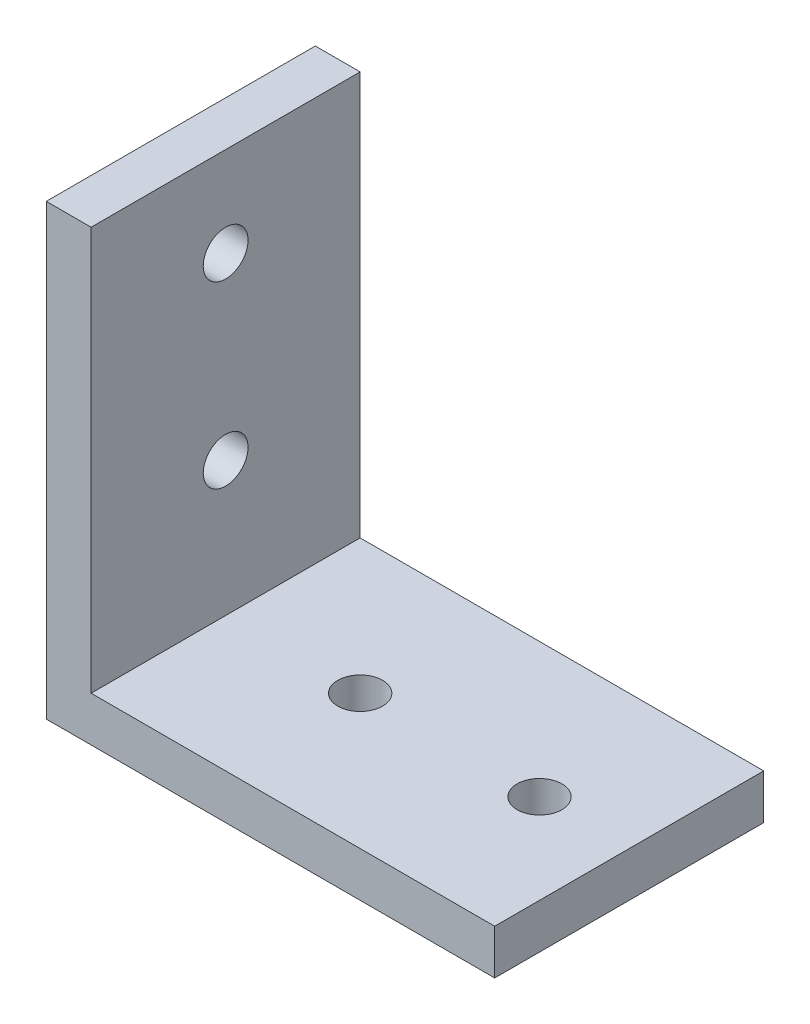
ISO-10303-21;
HEADER;
FILE_DESCRIPTION(('STEP AP214'),'2;1');
FILE_NAME('part.step','',(''),(''),'','','');
FILE_SCHEMA(('AUTOMOTIVE_DESIGN { 1 0 10303 214 1 1 1 1 }'));
ENDSEC;
DATA;
#1=APPLICATION_CONTEXT('core data for automotive mechanical design processes');
#2=APPLICATION_PROTOCOL_DEFINITION('international standard','automotive_design',2000,#1);
#3=PRODUCT_CONTEXT('',#1,'mechanical');
#4=PRODUCT('Part','Part','',(#3));
#5=PRODUCT_RELATED_PRODUCT_CATEGORY('part','',(#4));
#6=PRODUCT_DEFINITION_FORMATION('','',#4);
#7=PRODUCT_DEFINITION_CONTEXT('part definition',#1,'design');
#8=PRODUCT_DEFINITION('design','',#6,#7);
#9=PRODUCT_DEFINITION_SHAPE('','',#8);
#10=(LENGTH_UNIT() NAMED_UNIT(*) SI_UNIT(.MILLI.,.METRE.));
#11=(NAMED_UNIT(*) PLANE_ANGLE_UNIT() SI_UNIT($,.RADIAN.));
#12=(NAMED_UNIT(*) SI_UNIT($,.STERADIAN.) SOLID_ANGLE_UNIT());
#13=UNCERTAINTY_MEASURE_WITH_UNIT(LENGTH_MEASURE(1.E-05),#10,'distance_accuracy_value','');
#14=(GEOMETRIC_REPRESENTATION_CONTEXT(3) GLOBAL_UNCERTAINTY_ASSIGNED_CONTEXT((#13)) GLOBAL_UNIT_ASSIGNED_CONTEXT((#10,
#11,#12)) REPRESENTATION_CONTEXT('',''));
#15=CARTESIAN_POINT('',(0.,0.,0.));
#16=DIRECTION('',(0.,0.,1.));
#17=DIRECTION('',(1.,0.,0.));
#18=AXIS2_PLACEMENT_3D('',#15,#16,#17);
#19=CARTESIAN_POINT('',(100.,0.,30.));
#20=DIRECTION('',(0.,1.,0.));
#21=DIRECTION('',(-1.,0.,0.));
#22=AXIS2_PLACEMENT_3D('',#19,#20,#21);
#23=PLANE('',#22);
#24=CARTESIAN_POINT('',(40.,0.,0.));
#25=DIRECTION('',(0.,1.,0.));
#26=DIRECTION('',(-1.,0.,0.));
#27=AXIS2_PLACEMENT_3D('',#24,#25,#26);
#28=CIRCLE('',#27,5.00000000000001);
#29=CARTESIAN_POINT('',(35.,0.,0.));
#30=VERTEX_POINT('',#29);
#31=EDGE_CURVE('E166',#30,#30,#28,.T.);
#32=ORIENTED_EDGE('',*,*,#31,.T.);
#33=EDGE_LOOP('',(#32));
#34=FACE_BOUND('',#33,.T.);
#35=CARTESIAN_POINT('',(80.,0.,0.));
#36=DIRECTION('',(0.,1.,0.));
#37=DIRECTION('',(-1.,0.,0.));
#38=AXIS2_PLACEMENT_3D('',#35,#36,#37);
#39=CIRCLE('',#38,5.);
#40=CARTESIAN_POINT('',(75.,0.,0.));
#41=VERTEX_POINT('',#40);
#42=EDGE_CURVE('E169',#41,#41,#39,.T.);
#43=ORIENTED_EDGE('',*,*,#42,.T.);
#44=EDGE_LOOP('',(#43));
#45=FACE_BOUND('',#44,.T.);
#46=DIRECTION('',(1.,0.,0.));
#47=VECTOR('',#46,1.);
#48=CARTESIAN_POINT('',(100.,0.,-30.));
#49=LINE('',#48,#47);
#50=CARTESIAN_POINT('',(0.,0.,-30.));
#51=VERTEX_POINT('',#50);
#52=CARTESIAN_POINT('',(100.,0.,-30.));
#53=VERTEX_POINT('',#52);
#54=EDGE_CURVE('E120',#51,#53,#49,.T.);
#55=ORIENTED_EDGE('',*,*,#54,.T.);
#56=DIRECTION('',(0.,0.,-1.));
#57=VECTOR('',#56,1.);
#58=CARTESIAN_POINT('',(100.,0.,30.));
#59=LINE('',#58,#57);
#60=CARTESIAN_POINT('',(100.,0.,30.));
#61=VERTEX_POINT('',#60);
#62=EDGE_CURVE('E11',#61,#53,#59,.T.);
#63=ORIENTED_EDGE('',*,*,#62,.F.);
#64=DIRECTION('',(1.,0.,0.));
#65=VECTOR('',#64,1.);
#66=CARTESIAN_POINT('',(100.,0.,30.));
#67=LINE('',#66,#65);
#68=CARTESIAN_POINT('',(0.,0.,30.));
#69=VERTEX_POINT('',#68);
#70=EDGE_CURVE('E131',#69,#61,#67,.T.);
#71=ORIENTED_EDGE('',*,*,#70,.F.);
#72=DIRECTION('',(0.,0.,-1.));
#73=VECTOR('',#72,1.);
#74=CARTESIAN_POINT('',(0.,0.,30.));
#75=LINE('',#74,#73);
#76=EDGE_CURVE('E116',#69,#51,#75,.T.);
#77=ORIENTED_EDGE('',*,*,#76,.T.);
#78=EDGE_LOOP('',(#55,#63,#71,#77));
#79=FACE_BOUND('',#78,.T.);
#80=ADVANCED_FACE('F36',(#34,#45,#79),#23,.F.);
#81=CARTESIAN_POINT('',(100.,10.,30.));
#82=DIRECTION('',(-1.,0.,0.));
#83=DIRECTION('',(0.,0.,1.));
#84=AXIS2_PLACEMENT_3D('',#81,#82,#83);
#85=PLANE('',#84);
#86=DIRECTION('',(0.,1.,0.));
#87=VECTOR('',#86,1.);
#88=CARTESIAN_POINT('',(100.,10.,-30.));
#89=LINE('',#88,#87);
#90=CARTESIAN_POINT('',(100.,10.,-30.));
#91=VERTEX_POINT('',#90);
#92=EDGE_CURVE('E123',#53,#91,#89,.T.);
#93=ORIENTED_EDGE('',*,*,#92,.T.);
#94=DIRECTION('',(0.,0.,-1.));
#95=VECTOR('',#94,1.);
#96=CARTESIAN_POINT('',(100.,10.,30.));
#97=LINE('',#96,#95);
#98=CARTESIAN_POINT('',(100.,10.,30.));
#99=VERTEX_POINT('',#98);
#100=EDGE_CURVE('E44',#99,#91,#97,.T.);
#101=ORIENTED_EDGE('',*,*,#100,.F.);
#102=DIRECTION('',(0.,1.,0.));
#103=VECTOR('',#102,1.);
#104=CARTESIAN_POINT('',(100.,10.,30.));
#105=LINE('',#104,#103);
#106=EDGE_CURVE('E89',#61,#99,#105,.T.);
#107=ORIENTED_EDGE('',*,*,#106,.F.);
#108=ORIENTED_EDGE('',*,*,#62,.T.);
#109=EDGE_LOOP('',(#93,#101,#107,#108));
#110=FACE_BOUND('',#109,.T.);
#111=ADVANCED_FACE('F158',(#110),#85,.F.);
#112=CARTESIAN_POINT('',(10.,10.,30.));
#113=DIRECTION('',(0.,-1.,0.));
#114=DIRECTION('',(1.,0.,0.));
#115=AXIS2_PLACEMENT_3D('',#112,#113,#114);
#116=PLANE('',#115);
#117=CARTESIAN_POINT('',(40.,10.,0.));
#118=DIRECTION('',(0.,1.,0.));
#119=DIRECTION('',(-1.,0.,0.));
#120=AXIS2_PLACEMENT_3D('',#117,#118,#119);
#121=CIRCLE('',#120,5.00000000000001);
#122=CARTESIAN_POINT('',(35.,10.,0.));
#123=VERTEX_POINT('',#122);
#124=EDGE_CURVE('E180',#123,#123,#121,.T.);
#125=ORIENTED_EDGE('',*,*,#124,.F.);
#126=EDGE_LOOP('',(#125));
#127=FACE_BOUND('',#126,.T.);
#128=CARTESIAN_POINT('',(80.,10.,0.));
#129=DIRECTION('',(0.,1.,0.));
#130=DIRECTION('',(-1.,0.,0.));
#131=AXIS2_PLACEMENT_3D('',#128,#129,#130);
#132=CIRCLE('',#131,5.);
#133=CARTESIAN_POINT('',(75.,10.,0.));
#134=VERTEX_POINT('',#133);
#135=EDGE_CURVE('E172',#134,#134,#132,.T.);
#136=ORIENTED_EDGE('',*,*,#135,.F.);
#137=EDGE_LOOP('',(#136));
#138=FACE_BOUND('',#137,.T.);
#139=DIRECTION('',(-1.,0.,0.));
#140=VECTOR('',#139,1.);
#141=CARTESIAN_POINT('',(10.,10.,-30.));
#142=LINE('',#141,#140);
#143=CARTESIAN_POINT('',(10.,10.,-30.));
#144=VERTEX_POINT('',#143);
#145=EDGE_CURVE('E126',#91,#144,#142,.T.);
#146=ORIENTED_EDGE('',*,*,#145,.T.);
#147=DIRECTION('',(0.,0.,-1.));
#148=VECTOR('',#147,1.);
#149=CARTESIAN_POINT('',(10.,10.,30.));
#150=LINE('',#149,#148);
#151=CARTESIAN_POINT('',(10.,10.,30.));
#152=VERTEX_POINT('',#151);
#153=EDGE_CURVE('E111',#152,#144,#150,.T.);
#154=ORIENTED_EDGE('',*,*,#153,.F.);
#155=DIRECTION('',(-1.,0.,0.));
#156=VECTOR('',#155,1.);
#157=CARTESIAN_POINT('',(10.,10.,30.));
#158=LINE('',#157,#156);
#159=EDGE_CURVE('E102',#99,#152,#158,.T.);
#160=ORIENTED_EDGE('',*,*,#159,.F.);
#161=ORIENTED_EDGE('',*,*,#100,.T.);
#162=EDGE_LOOP('',(#146,#154,#160,#161));
#163=FACE_BOUND('',#162,.T.);
#164=ADVANCED_FACE('F137',(#127,#138,#163),#116,.F.);
#165=CARTESIAN_POINT('',(10.,100.,30.));
#166=DIRECTION('',(-1.,0.,0.));
#167=DIRECTION('',(0.,-1.,0.));
#168=AXIS2_PLACEMENT_3D('',#165,#166,#167);
#169=PLANE('',#168);
#170=CARTESIAN_POINT('',(10.,80.,0.));
#171=DIRECTION('',(1.,0.,0.));
#172=DIRECTION('',(0.,1.,0.));
#173=AXIS2_PLACEMENT_3D('',#170,#171,#172);
#174=CIRCLE('',#173,5.);
#175=CARTESIAN_POINT('',(10.,85.,0.));
#176=VERTEX_POINT('',#175);
#177=EDGE_CURVE('E171',#176,#176,#174,.T.);
#178=ORIENTED_EDGE('',*,*,#177,.F.);
#179=EDGE_LOOP('',(#178));
#180=FACE_BOUND('',#179,.T.);
#181=CARTESIAN_POINT('',(10.,40.,0.));
#182=DIRECTION('',(1.,0.,0.));
#183=DIRECTION('',(0.,1.,0.));
#184=AXIS2_PLACEMENT_3D('',#181,#182,#183);
#185=CIRCLE('',#184,5.);
#186=CARTESIAN_POINT('',(10.,45.,0.));
#187=VERTEX_POINT('',#186);
#188=EDGE_CURVE('E183',#187,#187,#185,.T.);
#189=ORIENTED_EDGE('',*,*,#188,.F.);
#190=EDGE_LOOP('',(#189));
#191=FACE_BOUND('',#190,.T.);
#192=DIRECTION('',(0.,1.,0.));
#193=VECTOR('',#192,1.);
#194=CARTESIAN_POINT('',(10.,100.,-30.));
#195=LINE('',#194,#193);
#196=CARTESIAN_POINT('',(10.,100.,-30.));
#197=VERTEX_POINT('',#196);
#198=EDGE_CURVE('E110',#144,#197,#195,.T.);
#199=ORIENTED_EDGE('',*,*,#198,.T.);
#200=DIRECTION('',(0.,0.,-1.));
#201=VECTOR('',#200,1.);
#202=CARTESIAN_POINT('',(10.,100.,30.));
#203=LINE('',#202,#201);
#204=CARTESIAN_POINT('',(10.,100.,30.));
#205=VERTEX_POINT('',#204);
#206=EDGE_CURVE('E107',#205,#197,#203,.T.);
#207=ORIENTED_EDGE('',*,*,#206,.F.);
#208=DIRECTION('',(0.,1.,0.));
#209=VECTOR('',#208,1.);
#210=CARTESIAN_POINT('',(10.,100.,30.));
#211=LINE('',#210,#209);
#212=EDGE_CURVE('E96',#152,#205,#211,.T.);
#213=ORIENTED_EDGE('',*,*,#212,.F.);
#214=ORIENTED_EDGE('',*,*,#153,.T.);
#215=EDGE_LOOP('',(#199,#207,#213,#214));
#216=FACE_BOUND('',#215,.T.);
#217=ADVANCED_FACE('F108',(#180,#191,#216),#169,.F.);
#218=CARTESIAN_POINT('',(0.,100.,30.));
#219=DIRECTION('',(0.,-1.,0.));
#220=DIRECTION('',(0.,0.,-1.));
#221=AXIS2_PLACEMENT_3D('',#218,#219,#220);
#222=PLANE('',#221);
#223=DIRECTION('',(-1.,0.,0.));
#224=VECTOR('',#223,1.);
#225=CARTESIAN_POINT('',(0.,100.,-30.));
#226=LINE('',#225,#224);
#227=CARTESIAN_POINT('',(0.,100.,-30.));
#228=VERTEX_POINT('',#227);
#229=EDGE_CURVE('E75',#197,#228,#226,.T.);
#230=ORIENTED_EDGE('',*,*,#229,.T.);
#231=DIRECTION('',(0.,0.,-1.));
#232=VECTOR('',#231,1.);
#233=CARTESIAN_POINT('',(0.,100.,30.));
#234=LINE('',#233,#232);
#235=CARTESIAN_POINT('',(0.,100.,30.));
#236=VERTEX_POINT('',#235);
#237=EDGE_CURVE('E112',#236,#228,#234,.T.);
#238=ORIENTED_EDGE('',*,*,#237,.F.);
#239=DIRECTION('',(-1.,0.,0.));
#240=VECTOR('',#239,1.);
#241=CARTESIAN_POINT('',(0.,100.,30.));
#242=LINE('',#241,#240);
#243=EDGE_CURVE('E100',#205,#236,#242,.T.);
#244=ORIENTED_EDGE('',*,*,#243,.F.);
#245=ORIENTED_EDGE('',*,*,#206,.T.);
#246=EDGE_LOOP('',(#230,#238,#244,#245));
#247=FACE_BOUND('',#246,.T.);
#248=ADVANCED_FACE('F114',(#247),#222,.F.);
#249=CARTESIAN_POINT('',(0.,0.,30.));
#250=DIRECTION('',(1.,0.,0.));
#251=DIRECTION('',(0.,0.,-1.));
#252=AXIS2_PLACEMENT_3D('',#249,#250,#251);
#253=PLANE('',#252);
#254=CARTESIAN_POINT('',(0.,80.,0.));
#255=DIRECTION('',(1.,0.,0.));
#256=DIRECTION('',(0.,1.,0.));
#257=AXIS2_PLACEMENT_3D('',#254,#255,#256);
#258=CIRCLE('',#257,5.);
#259=CARTESIAN_POINT('',(0.,85.,0.));
#260=VERTEX_POINT('',#259);
#261=EDGE_CURVE('E175',#260,#260,#258,.T.);
#262=ORIENTED_EDGE('',*,*,#261,.T.);
#263=EDGE_LOOP('',(#262));
#264=FACE_BOUND('',#263,.T.);
#265=CARTESIAN_POINT('',(0.,40.,0.));
#266=DIRECTION('',(1.,0.,0.));
#267=DIRECTION('',(0.,1.,0.));
#268=AXIS2_PLACEMENT_3D('',#265,#266,#267);
#269=CIRCLE('',#268,5.);
#270=CARTESIAN_POINT('',(0.,45.,0.));
#271=VERTEX_POINT('',#270);
#272=EDGE_CURVE('E124',#271,#271,#269,.T.);
#273=ORIENTED_EDGE('',*,*,#272,.T.);
#274=EDGE_LOOP('',(#273));
#275=FACE_BOUND('',#274,.T.);
#276=DIRECTION('',(0.,-1.,0.));
#277=VECTOR('',#276,1.);
#278=CARTESIAN_POINT('',(0.,0.,-30.));
#279=LINE('',#278,#277);
#280=EDGE_CURVE('E81',#228,#51,#279,.T.);
#281=ORIENTED_EDGE('',*,*,#280,.T.);
#282=ORIENTED_EDGE('',*,*,#76,.F.);
#283=DIRECTION('',(0.,-1.,0.));
#284=VECTOR('',#283,1.);
#285=CARTESIAN_POINT('',(0.,0.,30.));
#286=LINE('',#285,#284);
#287=EDGE_CURVE('E52',#236,#69,#286,.T.);
#288=ORIENTED_EDGE('',*,*,#287,.F.);
#289=ORIENTED_EDGE('',*,*,#237,.T.);
#290=EDGE_LOOP('',(#281,#282,#288,#289));
#291=FACE_BOUND('',#290,.T.);
#292=ADVANCED_FACE('F144',(#264,#275,#291),#253,.F.);
#293=CARTESIAN_POINT('',(0.,0.,30.));
#294=DIRECTION('',(0.,0.,-1.));
#295=DIRECTION('',(-1.,0.,0.));
#296=AXIS2_PLACEMENT_3D('',#293,#294,#295);
#297=PLANE('',#296);
#298=ORIENTED_EDGE('',*,*,#70,.T.);
#299=ORIENTED_EDGE('',*,*,#106,.T.);
#300=ORIENTED_EDGE('',*,*,#159,.T.);
#301=ORIENTED_EDGE('',*,*,#212,.T.);
#302=ORIENTED_EDGE('',*,*,#243,.T.);
#303=ORIENTED_EDGE('',*,*,#287,.T.);
#304=EDGE_LOOP('',(#298,#299,#300,#301,#302,#303));
#305=FACE_BOUND('',#304,.T.);
#306=ADVANCED_FACE('F98',(#305),#297,.F.);
#307=CARTESIAN_POINT('',(0.,0.,-30.));
#308=DIRECTION('',(0.,0.,-1.));
#309=DIRECTION('',(-1.,0.,0.));
#310=AXIS2_PLACEMENT_3D('',#307,#308,#309);
#311=PLANE('',#310);
#312=ORIENTED_EDGE('',*,*,#54,.F.);
#313=ORIENTED_EDGE('',*,*,#280,.F.);
#314=ORIENTED_EDGE('',*,*,#229,.F.);
#315=ORIENTED_EDGE('',*,*,#198,.F.);
#316=ORIENTED_EDGE('',*,*,#145,.F.);
#317=ORIENTED_EDGE('',*,*,#92,.F.);
#318=EDGE_LOOP('',(#312,#313,#314,#315,#316,#317));
#319=FACE_BOUND('',#318,.T.);
#320=ADVANCED_FACE('F140',(#319),#311,.T.);
#321=CARTESIAN_POINT('',(0.,40.,0.));
#322=DIRECTION('',(1.,0.,0.));
#323=DIRECTION('',(0.,1.,0.));
#324=AXIS2_PLACEMENT_3D('',#321,#322,#323);
#325=CYLINDRICAL_SURFACE('',#324,5.);
#326=ORIENTED_EDGE('',*,*,#272,.F.);
#327=EDGE_LOOP('',(#326));
#328=FACE_BOUND('',#327,.T.);
#329=ORIENTED_EDGE('',*,*,#188,.T.);
#330=EDGE_LOOP('',(#329));
#331=FACE_BOUND('',#330,.T.);
#332=ADVANCED_FACE('F192',(#328,#331),#325,.F.);
#333=CARTESIAN_POINT('',(0.,80.,0.));
#334=DIRECTION('',(1.,0.,0.));
#335=DIRECTION('',(0.,1.,0.));
#336=AXIS2_PLACEMENT_3D('',#333,#334,#335);
#337=CYLINDRICAL_SURFACE('',#336,5.);
#338=ORIENTED_EDGE('',*,*,#261,.F.);
#339=EDGE_LOOP('',(#338));
#340=FACE_BOUND('',#339,.T.);
#341=ORIENTED_EDGE('',*,*,#177,.T.);
#342=EDGE_LOOP('',(#341));
#343=FACE_BOUND('',#342,.T.);
#344=ADVANCED_FACE('F204',(#340,#343),#337,.F.);
#345=CARTESIAN_POINT('',(80.,0.,0.));
#346=DIRECTION('',(0.,1.,0.));
#347=DIRECTION('',(-1.,0.,0.));
#348=AXIS2_PLACEMENT_3D('',#345,#346,#347);
#349=CYLINDRICAL_SURFACE('',#348,5.);
#350=ORIENTED_EDGE('',*,*,#42,.F.);
#351=EDGE_LOOP('',(#350));
#352=FACE_BOUND('',#351,.T.);
#353=ORIENTED_EDGE('',*,*,#135,.T.);
#354=EDGE_LOOP('',(#353));
#355=FACE_BOUND('',#354,.T.);
#356=ADVANCED_FACE('F206',(#352,#355),#349,.F.);
#357=CARTESIAN_POINT('',(40.,0.,0.));
#358=DIRECTION('',(0.,1.,0.));
#359=DIRECTION('',(-1.,0.,0.));
#360=AXIS2_PLACEMENT_3D('',#357,#358,#359);
#361=CYLINDRICAL_SURFACE('',#360,5.00000000000001);
#362=ORIENTED_EDGE('',*,*,#31,.F.);
#363=EDGE_LOOP('',(#362));
#364=FACE_BOUND('',#363,.T.);
#365=ORIENTED_EDGE('',*,*,#124,.T.);
#366=EDGE_LOOP('',(#365));
#367=FACE_BOUND('',#366,.T.);
#368=ADVANCED_FACE('F213',(#364,#367),#361,.F.);
#369=CLOSED_SHELL('',(#80,#111,#164,#217,#248,#292,#306,#320,#332,#344,#356,#368));
#370=MANIFOLD_SOLID_BREP('B2',#369);
#371=ADVANCED_BREP_SHAPE_REPRESENTATION('',(#18,#370),#14);
#372=SHAPE_DEFINITION_REPRESENTATION(#9,#371);
ENDSEC;
END-ISO-10303-21;
